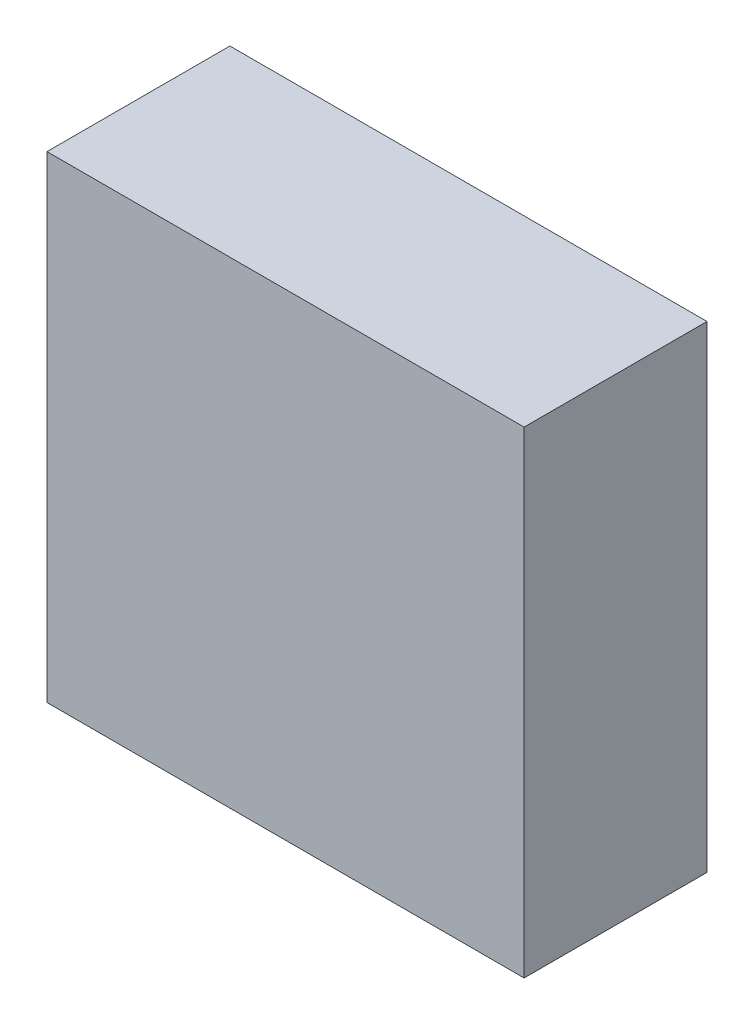
ISO-10303-21;
HEADER;
FILE_DESCRIPTION(('STEP AP214'),'2;1');
FILE_NAME('part.step','',(''),(''),'','','');
FILE_SCHEMA(('AUTOMOTIVE_DESIGN { 1 0 10303 214 1 1 1 1 }'));
ENDSEC;
DATA;
#1=APPLICATION_CONTEXT('core data for automotive mechanical design processes');
#2=APPLICATION_PROTOCOL_DEFINITION('international standard','automotive_design',2000,#1);
#3=PRODUCT_CONTEXT('',#1,'mechanical');
#4=PRODUCT('Part','Part','',(#3));
#5=PRODUCT_RELATED_PRODUCT_CATEGORY('part','',(#4));
#6=PRODUCT_DEFINITION_FORMATION('','',#4);
#7=PRODUCT_DEFINITION_CONTEXT('part definition',#1,'design');
#8=PRODUCT_DEFINITION('design','',#6,#7);
#9=PRODUCT_DEFINITION_SHAPE('','',#8);
#10=(LENGTH_UNIT() NAMED_UNIT(*) SI_UNIT(.MILLI.,.METRE.));
#11=(NAMED_UNIT(*) PLANE_ANGLE_UNIT() SI_UNIT($,.RADIAN.));
#12=(NAMED_UNIT(*) SI_UNIT($,.STERADIAN.) SOLID_ANGLE_UNIT());
#13=UNCERTAINTY_MEASURE_WITH_UNIT(LENGTH_MEASURE(1.E-05),#10,'distance_accuracy_value','');
#14=(GEOMETRIC_REPRESENTATION_CONTEXT(3) GLOBAL_UNCERTAINTY_ASSIGNED_CONTEXT((#13)) GLOBAL_UNIT_ASSIGNED_CONTEXT((#10,
#11,#12)) REPRESENTATION_CONTEXT('',''));
#15=CARTESIAN_POINT('',(0.,0.,0.));
#16=DIRECTION('',(0.,0.,1.));
#17=DIRECTION('',(1.,0.,0.));
#18=AXIS2_PLACEMENT_3D('',#15,#16,#17);
#19=CARTESIAN_POINT('',(17.249587155177,15.3126483669053,2.3));
#20=DIRECTION('',(1.,0.,0.));
#21=DIRECTION('',(0.,1.,0.));
#22=AXIS2_PLACEMENT_3D('',#19,#20,#21);
#23=PLANE('',#22);
#24=DIRECTION('',(0.,-1.,0.));
#25=VECTOR('',#24,1.);
#26=CARTESIAN_POINT('',(17.249587155177,15.3126483669053,0.));
#27=LINE('',#26,#25);
#28=CARTESIAN_POINT('',(17.249587155177,15.3126483669053,0.));
#29=VERTEX_POINT('',#28);
#30=CARTESIAN_POINT('',(17.249587155177,9.31264836690532,0.));
#31=VERTEX_POINT('',#30);
#32=EDGE_CURVE('E100',#29,#31,#27,.T.);
#33=ORIENTED_EDGE('',*,*,#32,.T.);
#34=DIRECTION('',(0.,0.,-1.));
#35=VECTOR('',#34,1.);
#36=CARTESIAN_POINT('',(17.249587155177,9.31264836690532,2.3));
#37=LINE('',#36,#35);
#38=CARTESIAN_POINT('',(17.249587155177,9.31264836690532,2.3));
#39=VERTEX_POINT('',#38);
#40=EDGE_CURVE('E11',#39,#31,#37,.T.);
#41=ORIENTED_EDGE('',*,*,#40,.F.);
#42=DIRECTION('',(0.,-1.,0.));
#43=VECTOR('',#42,1.);
#44=CARTESIAN_POINT('',(17.249587155177,15.3126483669053,2.3));
#45=LINE('',#44,#43);
#46=CARTESIAN_POINT('',(17.249587155177,15.3126483669053,2.3));
#47=VERTEX_POINT('',#46);
#48=EDGE_CURVE('E88',#47,#39,#45,.T.);
#49=ORIENTED_EDGE('',*,*,#48,.F.);
#50=DIRECTION('',(0.,0.,-1.));
#51=VECTOR('',#50,1.);
#52=CARTESIAN_POINT('',(17.249587155177,15.3126483669053,2.3));
#53=LINE('',#52,#51);
#54=EDGE_CURVE('E96',#47,#29,#53,.T.);
#55=ORIENTED_EDGE('',*,*,#54,.T.);
#56=EDGE_LOOP('',(#33,#41,#49,#55));
#57=FACE_BOUND('',#56,.T.);
#58=ADVANCED_FACE('F37',(#57),#23,.F.);
#59=CARTESIAN_POINT('',(17.249587155177,9.31264836690532,2.3));
#60=DIRECTION('',(0.,1.,0.));
#61=DIRECTION('',(0.,0.,1.));
#62=AXIS2_PLACEMENT_3D('',#59,#60,#61);
#63=PLANE('',#62);
#64=DIRECTION('',(1.,0.,0.));
#65=VECTOR('',#64,1.);
#66=CARTESIAN_POINT('',(17.249587155177,9.31264836690532,0.));
#67=LINE('',#66,#65);
#68=CARTESIAN_POINT('',(23.249587155177,9.31264836690532,0.));
#69=VERTEX_POINT('',#68);
#70=EDGE_CURVE('E92',#31,#69,#67,.T.);
#71=ORIENTED_EDGE('',*,*,#70,.T.);
#72=DIRECTION('',(0.,0.,-1.));
#73=VECTOR('',#72,1.);
#74=CARTESIAN_POINT('',(23.249587155177,9.31264836690532,2.3));
#75=LINE('',#74,#73);
#76=CARTESIAN_POINT('',(23.249587155177,9.31264836690532,2.3));
#77=VERTEX_POINT('',#76);
#78=EDGE_CURVE('E45',#77,#69,#75,.T.);
#79=ORIENTED_EDGE('',*,*,#78,.F.);
#80=DIRECTION('',(1.,0.,0.));
#81=VECTOR('',#80,1.);
#82=CARTESIAN_POINT('',(17.249587155177,9.31264836690532,2.3));
#83=LINE('',#82,#81);
#84=EDGE_CURVE('E83',#39,#77,#83,.T.);
#85=ORIENTED_EDGE('',*,*,#84,.F.);
#86=ORIENTED_EDGE('',*,*,#40,.T.);
#87=EDGE_LOOP('',(#71,#79,#85,#86));
#88=FACE_BOUND('',#87,.T.);
#89=ADVANCED_FACE('F91',(#88),#63,.F.);
#90=CARTESIAN_POINT('',(23.249587155177,15.3126483669053,2.3));
#91=DIRECTION('',(-1.,0.,0.));
#92=DIRECTION('',(0.,-1.,0.));
#93=AXIS2_PLACEMENT_3D('',#90,#91,#92);
#94=PLANE('',#93);
#95=DIRECTION('',(0.,1.,0.));
#96=VECTOR('',#95,1.);
#97=CARTESIAN_POINT('',(23.249587155177,15.3126483669053,0.));
#98=LINE('',#97,#96);
#99=CARTESIAN_POINT('',(23.249587155177,15.3126483669053,0.));
#100=VERTEX_POINT('',#99);
#101=EDGE_CURVE('E70',#69,#100,#98,.T.);
#102=ORIENTED_EDGE('',*,*,#101,.T.);
#103=DIRECTION('',(0.,0.,-1.));
#104=VECTOR('',#103,1.);
#105=CARTESIAN_POINT('',(23.249587155177,15.3126483669053,2.3));
#106=LINE('',#105,#104);
#107=CARTESIAN_POINT('',(23.249587155177,15.3126483669053,2.3));
#108=VERTEX_POINT('',#107);
#109=EDGE_CURVE('E93',#108,#100,#106,.T.);
#110=ORIENTED_EDGE('',*,*,#109,.F.);
#111=DIRECTION('',(0.,1.,0.));
#112=VECTOR('',#111,1.);
#113=CARTESIAN_POINT('',(23.249587155177,15.3126483669053,2.3));
#114=LINE('',#113,#112);
#115=EDGE_CURVE('E86',#77,#108,#114,.T.);
#116=ORIENTED_EDGE('',*,*,#115,.F.);
#117=ORIENTED_EDGE('',*,*,#78,.T.);
#118=EDGE_LOOP('',(#102,#110,#116,#117));
#119=FACE_BOUND('',#118,.T.);
#120=ADVANCED_FACE('F94',(#119),#94,.F.);
#121=CARTESIAN_POINT('',(17.249587155177,15.3126483669053,2.3));
#122=DIRECTION('',(0.,-1.,0.));
#123=DIRECTION('',(0.,0.,-1.));
#124=AXIS2_PLACEMENT_3D('',#121,#122,#123);
#125=PLANE('',#124);
#126=DIRECTION('',(-1.,0.,0.));
#127=VECTOR('',#126,1.);
#128=CARTESIAN_POINT('',(17.249587155177,15.3126483669053,0.));
#129=LINE('',#128,#127);
#130=EDGE_CURVE('E76',#100,#29,#129,.T.);
#131=ORIENTED_EDGE('',*,*,#130,.T.);
#132=ORIENTED_EDGE('',*,*,#54,.F.);
#133=DIRECTION('',(-1.,0.,0.));
#134=VECTOR('',#133,1.);
#135=CARTESIAN_POINT('',(17.249587155177,15.3126483669053,2.3));
#136=LINE('',#135,#134);
#137=EDGE_CURVE('E53',#108,#47,#136,.T.);
#138=ORIENTED_EDGE('',*,*,#137,.F.);
#139=ORIENTED_EDGE('',*,*,#109,.T.);
#140=EDGE_LOOP('',(#131,#132,#138,#139));
#141=FACE_BOUND('',#140,.T.);
#142=ADVANCED_FACE('F107',(#141),#125,.F.);
#143=CARTESIAN_POINT('',(0.,0.,2.3));
#144=DIRECTION('',(0.,0.,1.));
#145=DIRECTION('',(1.,0.,0.));
#146=AXIS2_PLACEMENT_3D('',#143,#144,#145);
#147=PLANE('',#146);
#148=ORIENTED_EDGE('',*,*,#48,.T.);
#149=ORIENTED_EDGE('',*,*,#84,.T.);
#150=ORIENTED_EDGE('',*,*,#115,.T.);
#151=ORIENTED_EDGE('',*,*,#137,.T.);
#152=EDGE_LOOP('',(#148,#149,#150,#151));
#153=FACE_BOUND('',#152,.T.);
#154=ADVANCED_FACE('F84',(#153),#147,.T.);
#155=CARTESIAN_POINT('',(0.,0.,0.));
#156=DIRECTION('',(0.,0.,1.));
#157=DIRECTION('',(1.,0.,0.));
#158=AXIS2_PLACEMENT_3D('',#155,#156,#157);
#159=PLANE('',#158);
#160=ORIENTED_EDGE('',*,*,#32,.F.);
#161=ORIENTED_EDGE('',*,*,#130,.F.);
#162=ORIENTED_EDGE('',*,*,#101,.F.);
#163=ORIENTED_EDGE('',*,*,#70,.F.);
#164=EDGE_LOOP('',(#160,#161,#162,#163));
#165=FACE_BOUND('',#164,.T.);
#166=ADVANCED_FACE('F110',(#165),#159,.F.);
#167=CLOSED_SHELL('',(#58,#89,#120,#142,#154,#166));
#168=MANIFOLD_SOLID_BREP('B2',#167);
#169=ADVANCED_BREP_SHAPE_REPRESENTATION('',(#18,#168),#14);
#170=SHAPE_DEFINITION_REPRESENTATION(#9,#169);
ENDSEC;
END-ISO-10303-21;
